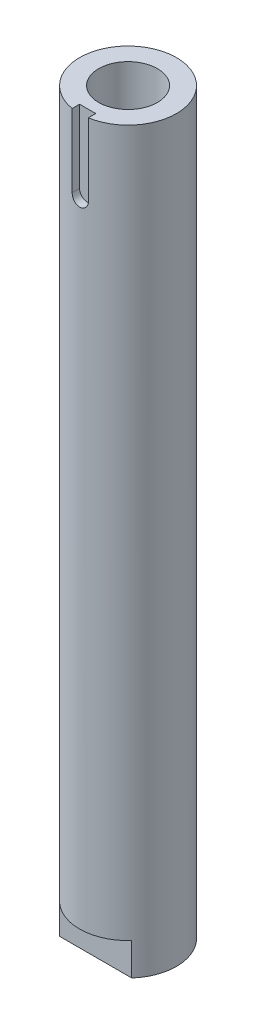
ISO-10303-21;
HEADER;
FILE_DESCRIPTION(('STEP AP214'),'2;1');
FILE_NAME('part.step','',(''),(''),'','','');
FILE_SCHEMA(('AUTOMOTIVE_DESIGN { 1 0 10303 214 1 1 1 1 }'));
ENDSEC;
DATA;
#1=APPLICATION_CONTEXT('core data for automotive mechanical design processes');
#2=APPLICATION_PROTOCOL_DEFINITION('international standard','automotive_design',2000,#1);
#3=PRODUCT_CONTEXT('',#1,'mechanical');
#4=PRODUCT('Part','Part','',(#3));
#5=PRODUCT_RELATED_PRODUCT_CATEGORY('part','',(#4));
#6=PRODUCT_DEFINITION_FORMATION('','',#4);
#7=PRODUCT_DEFINITION_CONTEXT('part definition',#1,'design');
#8=PRODUCT_DEFINITION('design','',#6,#7);
#9=PRODUCT_DEFINITION_SHAPE('','',#8);
#10=(LENGTH_UNIT() NAMED_UNIT(*) SI_UNIT(.MILLI.,.METRE.));
#11=(NAMED_UNIT(*) PLANE_ANGLE_UNIT() SI_UNIT($,.RADIAN.));
#12=(NAMED_UNIT(*) SI_UNIT($,.STERADIAN.) SOLID_ANGLE_UNIT());
#13=UNCERTAINTY_MEASURE_WITH_UNIT(LENGTH_MEASURE(1.E-05),#10,'distance_accuracy_value','');
#14=(GEOMETRIC_REPRESENTATION_CONTEXT(3) GLOBAL_UNCERTAINTY_ASSIGNED_CONTEXT((#13)) GLOBAL_UNIT_ASSIGNED_CONTEXT((#10,
#11,#12)) REPRESENTATION_CONTEXT('',''));
#15=CARTESIAN_POINT('',(0.,0.,0.));
#16=DIRECTION('',(0.,0.,1.));
#17=DIRECTION('',(1.,0.,0.));
#18=AXIS2_PLACEMENT_3D('',#15,#16,#17);
#19=CARTESIAN_POINT('',(0.,144.78,0.));
#20=DIRECTION('',(0.,-1.,0.));
#21=DIRECTION('',(0.,0.,-1.));
#22=AXIS2_PLACEMENT_3D('',#19,#20,#21);
#23=CYLINDRICAL_SURFACE('',#22,9.5);
#24=DIRECTION('',(0.,-1.,0.));
#25=VECTOR('',#24,1.);
#26=CARTESIAN_POINT('',(1.5875,144.78,9.36642107477557));
#27=LINE('',#26,#25);
#28=CARTESIAN_POINT('',(1.5875,144.78,9.36642107477557));
#29=VERTEX_POINT('',#28);
#30=CARTESIAN_POINT('',(1.5875,130.4925,9.36642107477557));
#31=VERTEX_POINT('',#30);
#32=EDGE_CURVE('E140',#29,#31,#27,.T.);
#33=ORIENTED_EDGE('',*,*,#32,.T.);
#34=CARTESIAN_POINT('',(1.5875,130.4925,9.36642107477557));
#35=CARTESIAN_POINT('',(1.58750007501885,130.448169619652,9.36641921892386));
#36=CARTESIAN_POINT('',(1.5856419610287,130.40386078706,9.3667361928873));
#37=CARTESIAN_POINT('',(1.57823162464586,130.315566372598,9.36798835641105));
#38=CARTESIAN_POINT('',(1.57267977304643,130.271580758729,9.36892348391838));
#39=CARTESIAN_POINT('',(1.55054841782113,130.14070457561,9.37262169247182));
#40=CARTESIAN_POINT('',(1.52849288862633,130.054700462017,9.37627776509836));
#41=CARTESIAN_POINT('',(1.47043626243605,129.887683140406,9.38555647204461));
#42=CARTESIAN_POINT('',(1.43443212041241,129.806671026636,9.39117953573891));
#43=CARTESIAN_POINT('',(1.34952212214638,129.651821922861,9.4037559197276));
#44=CARTESIAN_POINT('',(1.30061608396009,129.577985034062,9.41070925878129));
#45=CARTESIAN_POINT('',(1.19078282685551,129.438879530828,9.42523859478271));
#46=CARTESIAN_POINT('',(1.12975407847038,129.373691620099,9.43281951159274));
#47=CARTESIAN_POINT('',(0.997619851457473,129.254423749217,9.44770696834754));
#48=CARTESIAN_POINT('',(0.926512830712889,129.200345492105,9.45501346608552));
#49=CARTESIAN_POINT('',(0.775717083435957,129.104535370015,9.46858062743225));
#50=CARTESIAN_POINT('',(0.695979552642045,129.062879318183,9.47483477149543));
#51=CARTESIAN_POINT('',(0.530521537046084,128.993585198442,9.48553693059973));
#52=CARTESIAN_POINT('',(0.444801784471325,128.965945418345,9.48998516623226));
#53=CARTESIAN_POINT('',(0.270650909307135,128.925714455716,9.49653974390474));
#54=CARTESIAN_POINT('',(0.182252251484412,128.91298626881,9.49866739424712));
#55=CARTESIAN_POINT('',(0.00454802796144723,128.902513667192,9.50041431134813));
#56=CARTESIAN_POINT('',(-0.084757497112693,128.904768584193,9.50003368998238));
#57=CARTESIAN_POINT('',(-0.260798996441161,128.92409192674,9.49682371869066));
#58=CARTESIAN_POINT('',(-0.347551708269536,128.941012508969,9.49401880860184));
#59=CARTESIAN_POINT('',(-0.516968402398845,128.988953943214,9.48630271078437));
#60=CARTESIAN_POINT('',(-0.599632285720329,129.019975136384,9.48139147209503));
#61=CARTESIAN_POINT('',(-0.758966222269138,129.095384596139,9.46997286648615));
#62=CARTESIAN_POINT('',(-0.83560680666385,129.139833981496,9.46345822731532));
#63=CARTESIAN_POINT('',(-0.980394174284694,129.240791729489,9.44955687980754));
#64=CARTESIAN_POINT('',(-1.04854058158111,129.297300625548,9.44217013290156));
#65=CARTESIAN_POINT('',(-1.17527363343468,129.421584533438,9.42724032743146));
#66=CARTESIAN_POINT('',(-1.23373490550291,129.489487346269,9.41969645843769));
#67=CARTESIAN_POINT('',(-1.3384709684682,129.63422762956,9.40538672723832));
#68=CARTESIAN_POINT('',(-1.38474228632668,129.711067637347,9.39862108706645));
#69=CARTESIAN_POINT('',(-1.46381015666552,129.871657774666,9.38663241153215));
#70=CARTESIAN_POINT('',(-1.49658367361663,129.955419426754,9.38141201754237));
#71=CARTESIAN_POINT('',(-1.54751389900157,130.127308423917,9.37314662649488));
#72=CARTESIAN_POINT('',(-1.56569245947298,130.215429031809,9.37009837800357));
#73=CARTESIAN_POINT('',(-1.58004252304751,130.335600183159,9.36768235628324));
#74=CARTESIAN_POINT('',(-1.58284024148826,130.366940751575,9.36720979944117));
#75=CARTESIAN_POINT('',(-1.5865665471886,130.429682975478,9.36657947613833));
#76=CARTESIAN_POINT('',(-1.58749827781785,130.461084438885,9.36642118028978));
#77=CARTESIAN_POINT('',(-1.5875,130.4925,9.36642107477557));
#78=B_SPLINE_CURVE_WITH_KNOTS('',3,(#34,#35,#36,#37,#38,#39,#40,#41,#42,#43,#44,#45,#46,#47,#48,
#49,#50,#51,#52,#53,#54,#55,#56,#57,#58,#59,#60,#61,#62,#63,#64,#65,#66,#67,#68,#69,#70,#71,#72,
#73,#74,#75,#76,#77),.UNSPECIFIED.,.F.,.F.,(4,2,2,2,2,2,2,2,2,2,2,2,2,2,2,2,2,2,2,2,2,4),(0.,
0.13290846118484,0.265803582459427,0.531018714625842,0.796291776783844,1.06156858005068,
1.32916865818416,1.59680972717122,1.86605227558262,2.13526192616084,2.40197824342038,
2.66868266449888,2.93272932597956,3.19678237618886,3.46205585658109,3.72734107310766,
3.99582966128416,4.26439466199042,4.53341611886121,4.80203403307315,4.89639745955361,
4.99060179095765),.UNSPECIFIED.);
#79=CARTESIAN_POINT('',(-1.5875,130.4925,9.36642107477557));
#80=VERTEX_POINT('',#79);
#81=EDGE_CURVE('E11',#31,#80,#78,.T.);
#82=ORIENTED_EDGE('',*,*,#81,.T.);
#83=DIRECTION('',(0.,-1.,0.));
#84=VECTOR('',#83,1.);
#85=CARTESIAN_POINT('',(-1.5875,144.78,9.36642107477557));
#86=LINE('',#85,#84);
#87=CARTESIAN_POINT('',(-1.5875,144.78,9.36642107477557));
#88=VERTEX_POINT('',#87);
#89=EDGE_CURVE('E145',#80,#88,#86,.F.);
#90=ORIENTED_EDGE('',*,*,#89,.T.);
#91=CARTESIAN_POINT('',(0.,144.78,0.));
#92=DIRECTION('',(0.,1.,0.));
#93=DIRECTION('',(0.,0.,1.));
#94=AXIS2_PLACEMENT_3D('',#91,#92,#93);
#95=CIRCLE('',#94,9.5);
#96=EDGE_CURVE('E52',#29,#88,#95,.T.);
#97=ORIENTED_EDGE('',*,*,#96,.F.);
#98=EDGE_LOOP('',(#33,#82,#90,#97));
#99=FACE_BOUND('',#98,.T.);
#100=CARTESIAN_POINT('',(0.,6.35,0.));
#101=DIRECTION('',(0.,-1.,0.));
#102=DIRECTION('',(0.,0.,-1.));
#103=AXIS2_PLACEMENT_3D('',#100,#101,#102);
#104=CIRCLE('',#103,9.5);
#105=CARTESIAN_POINT('',(7.06593942798833,6.35,6.35));
#106=VERTEX_POINT('',#105);
#107=CARTESIAN_POINT('',(-7.06593942798833,6.35,6.35));
#108=VERTEX_POINT('',#107);
#109=EDGE_CURVE('E161',#106,#108,#104,.T.);
#110=ORIENTED_EDGE('',*,*,#109,.F.);
#111=DIRECTION('',(0.,-1.,0.));
#112=VECTOR('',#111,1.);
#113=CARTESIAN_POINT('',(7.06593942798833,6.35,6.35));
#114=LINE('',#113,#112);
#115=CARTESIAN_POINT('',(7.06593942798833,0.,6.35));
#116=VERTEX_POINT('',#115);
#117=EDGE_CURVE('E169',#106,#116,#114,.T.);
#118=ORIENTED_EDGE('',*,*,#117,.T.);
#119=CARTESIAN_POINT('',(0.,0.,0.));
#120=DIRECTION('',(0.,1.,0.));
#121=DIRECTION('',(0.,0.,1.));
#122=AXIS2_PLACEMENT_3D('',#119,#120,#121);
#123=CIRCLE('',#122,9.5);
#124=CARTESIAN_POINT('',(7.06593942798833,0.,-6.35));
#125=VERTEX_POINT('',#124);
#126=EDGE_CURVE('E186',#116,#125,#123,.T.);
#127=ORIENTED_EDGE('',*,*,#126,.T.);
#128=DIRECTION('',(0.,-1.,0.));
#129=VECTOR('',#128,1.);
#130=CARTESIAN_POINT('',(7.06593942798833,6.35,-6.35));
#131=LINE('',#130,#129);
#132=CARTESIAN_POINT('',(7.06593942798833,6.35,-6.35));
#133=VERTEX_POINT('',#132);
#134=EDGE_CURVE('E179',#133,#125,#131,.T.);
#135=ORIENTED_EDGE('',*,*,#134,.F.);
#136=CARTESIAN_POINT('',(0.,6.35,0.));
#137=DIRECTION('',(0.,-1.,0.));
#138=DIRECTION('',(0.,0.,-1.));
#139=AXIS2_PLACEMENT_3D('',#136,#137,#138);
#140=CIRCLE('',#139,9.5);
#141=CARTESIAN_POINT('',(-7.06593942798833,6.35,-6.35));
#142=VERTEX_POINT('',#141);
#143=EDGE_CURVE('E174',#142,#133,#140,.T.);
#144=ORIENTED_EDGE('',*,*,#143,.F.);
#145=DIRECTION('',(0.,-1.,0.));
#146=VECTOR('',#145,1.);
#147=CARTESIAN_POINT('',(-7.06593942798833,6.35,-6.35));
#148=LINE('',#147,#146);
#149=CARTESIAN_POINT('',(-7.06593942798833,0.,-6.35));
#150=VERTEX_POINT('',#149);
#151=EDGE_CURVE('E168',#142,#150,#148,.T.);
#152=ORIENTED_EDGE('',*,*,#151,.T.);
#153=CARTESIAN_POINT('',(-7.06593942798833,0.,6.35));
#154=VERTEX_POINT('',#153);
#155=EDGE_CURVE('E172',#150,#154,#123,.T.);
#156=ORIENTED_EDGE('',*,*,#155,.T.);
#157=DIRECTION('',(0.,-1.,0.));
#158=VECTOR('',#157,1.);
#159=CARTESIAN_POINT('',(-7.06593942798833,6.35,6.35));
#160=LINE('',#159,#158);
#161=EDGE_CURVE('E67',#108,#154,#160,.T.);
#162=ORIENTED_EDGE('',*,*,#161,.F.);
#163=EDGE_LOOP('',(#110,#118,#127,#135,#144,#152,#156,#162));
#164=FACE_BOUND('',#163,.T.);
#165=ADVANCED_FACE('F40',(#99,#164),#23,.T.);
#166=CARTESIAN_POINT('',(0.,144.78,0.));
#167=DIRECTION('',(0.,1.,0.));
#168=DIRECTION('',(0.,0.,1.));
#169=AXIS2_PLACEMENT_3D('',#166,#167,#168);
#170=PLANE('',#169);
#171=DIRECTION('',(0.,0.,1.));
#172=VECTOR('',#171,1.);
#173=CARTESIAN_POINT('',(-1.5875,144.78,7.9125));
#174=LINE('',#173,#172);
#175=CARTESIAN_POINT('',(-1.5875,144.78,7.9125));
#176=VERTEX_POINT('',#175);
#177=EDGE_CURVE('E141',#176,#88,#174,.T.);
#178=ORIENTED_EDGE('',*,*,#177,.F.);
#179=DIRECTION('',(-1.,0.,0.));
#180=VECTOR('',#179,1.);
#181=CARTESIAN_POINT('',(-1.5875,144.78,7.9125));
#182=LINE('',#181,#180);
#183=CARTESIAN_POINT('',(1.5875,144.78,7.9125));
#184=VERTEX_POINT('',#183);
#185=EDGE_CURVE('E130',#184,#176,#182,.T.);
#186=ORIENTED_EDGE('',*,*,#185,.F.);
#187=DIRECTION('',(0.,0.,1.));
#188=VECTOR('',#187,1.);
#189=CARTESIAN_POINT('',(1.5875,144.78,7.9125));
#190=LINE('',#189,#188);
#191=EDGE_CURVE('E124',#184,#29,#190,.T.);
#192=ORIENTED_EDGE('',*,*,#191,.T.);
#193=ORIENTED_EDGE('',*,*,#96,.T.);
#194=EDGE_LOOP('',(#178,#186,#192,#193));
#195=FACE_BOUND('',#194,.T.);
#196=CARTESIAN_POINT('',(0.,144.78,0.));
#197=DIRECTION('',(0.,1.,0.));
#198=DIRECTION('',(0.,0.,1.));
#199=AXIS2_PLACEMENT_3D('',#196,#197,#198);
#200=CIRCLE('',#199,5.75437);
#201=CARTESIAN_POINT('',(0.,144.78,5.75437));
#202=VERTEX_POINT('',#201);
#203=EDGE_CURVE('E148',#202,#202,#200,.T.);
#204=ORIENTED_EDGE('',*,*,#203,.F.);
#205=EDGE_LOOP('',(#204));
#206=FACE_BOUND('',#205,.T.);
#207=ADVANCED_FACE('F214',(#195,#206),#170,.T.);
#208=CARTESIAN_POINT('',(0.,0.,0.));
#209=DIRECTION('',(0.,1.,0.));
#210=DIRECTION('',(0.,0.,1.));
#211=AXIS2_PLACEMENT_3D('',#208,#209,#210);
#212=PLANE('',#211);
#213=CARTESIAN_POINT('',(0.,0.,0.));
#214=DIRECTION('',(0.,-1.,0.));
#215=DIRECTION('',(0.,0.,-1.));
#216=AXIS2_PLACEMENT_3D('',#213,#214,#215);
#217=CIRCLE('',#216,2.5527);
#218=CARTESIAN_POINT('',(0.,0.,-2.5527));
#219=VERTEX_POINT('',#218);
#220=EDGE_CURVE('E154',#219,#219,#217,.T.);
#221=ORIENTED_EDGE('',*,*,#220,.F.);
#222=EDGE_LOOP('',(#221));
#223=FACE_BOUND('',#222,.T.);
#224=ORIENTED_EDGE('',*,*,#126,.F.);
#225=DIRECTION('',(1.,0.,0.));
#226=VECTOR('',#225,1.);
#227=CARTESIAN_POINT('',(-7.06593942798833,0.,6.35));
#228=LINE('',#227,#226);
#229=EDGE_CURVE('E164',#154,#116,#228,.T.);
#230=ORIENTED_EDGE('',*,*,#229,.F.);
#231=ORIENTED_EDGE('',*,*,#155,.F.);
#232=DIRECTION('',(-1.,0.,0.));
#233=VECTOR('',#232,1.);
#234=CARTESIAN_POINT('',(-7.06593942798833,0.,-6.35));
#235=LINE('',#234,#233);
#236=EDGE_CURVE('E160',#125,#150,#235,.T.);
#237=ORIENTED_EDGE('',*,*,#236,.F.);
#238=EDGE_LOOP('',(#224,#230,#231,#237));
#239=FACE_BOUND('',#238,.T.);
#240=ADVANCED_FACE('F197',(#223,#239),#212,.F.);
#241=CARTESIAN_POINT('',(-7.06593942798833,6.35,-6.35));
#242=DIRECTION('',(0.,0.,1.));
#243=DIRECTION('',(1.,0.,0.));
#244=AXIS2_PLACEMENT_3D('',#241,#242,#243);
#245=PLANE('',#244);
#246=ORIENTED_EDGE('',*,*,#236,.T.);
#247=ORIENTED_EDGE('',*,*,#151,.F.);
#248=DIRECTION('',(-1.,0.,0.));
#249=VECTOR('',#248,1.);
#250=CARTESIAN_POINT('',(-7.06593942798833,6.35,-6.35));
#251=LINE('',#250,#249);
#252=EDGE_CURVE('E176',#133,#142,#251,.T.);
#253=ORIENTED_EDGE('',*,*,#252,.F.);
#254=ORIENTED_EDGE('',*,*,#134,.T.);
#255=EDGE_LOOP('',(#246,#247,#253,#254));
#256=FACE_BOUND('',#255,.T.);
#257=ADVANCED_FACE('F253',(#256),#245,.F.);
#258=CARTESIAN_POINT('',(0.,6.35,0.));
#259=DIRECTION('',(0.,-1.,0.));
#260=DIRECTION('',(0.,0.,-1.));
#261=AXIS2_PLACEMENT_3D('',#258,#259,#260);
#262=PLANE('',#261);
#263=ORIENTED_EDGE('',*,*,#143,.T.);
#264=ORIENTED_EDGE('',*,*,#252,.T.);
#265=EDGE_LOOP('',(#263,#264));
#266=FACE_BOUND('',#265,.T.);
#267=ADVANCED_FACE('F211',(#266),#262,.T.);
#268=CARTESIAN_POINT('',(-7.06593942798833,6.35,6.35));
#269=DIRECTION('',(0.,0.,-1.));
#270=DIRECTION('',(-1.,0.,0.));
#271=AXIS2_PLACEMENT_3D('',#268,#269,#270);
#272=PLANE('',#271);
#273=ORIENTED_EDGE('',*,*,#229,.T.);
#274=ORIENTED_EDGE('',*,*,#117,.F.);
#275=DIRECTION('',(1.,0.,0.));
#276=VECTOR('',#275,1.);
#277=CARTESIAN_POINT('',(-7.06593942798833,6.35,6.35));
#278=LINE('',#277,#276);
#279=EDGE_CURVE('E163',#108,#106,#278,.T.);
#280=ORIENTED_EDGE('',*,*,#279,.F.);
#281=ORIENTED_EDGE('',*,*,#161,.T.);
#282=EDGE_LOOP('',(#273,#274,#280,#281));
#283=FACE_BOUND('',#282,.T.);
#284=ADVANCED_FACE('F198',(#283),#272,.F.);
#285=CARTESIAN_POINT('',(0.,6.35,0.));
#286=DIRECTION('',(0.,-1.,0.));
#287=DIRECTION('',(0.,0.,-1.));
#288=AXIS2_PLACEMENT_3D('',#285,#286,#287);
#289=PLANE('',#288);
#290=ORIENTED_EDGE('',*,*,#109,.T.);
#291=ORIENTED_EDGE('',*,*,#279,.T.);
#292=EDGE_LOOP('',(#290,#291));
#293=FACE_BOUND('',#292,.T.);
#294=ADVANCED_FACE('F200',(#293),#289,.T.);
#295=CARTESIAN_POINT('',(0.,31.75,0.));
#296=DIRECTION('',(0.,-1.,0.));
#297=DIRECTION('',(0.,0.,-1.));
#298=AXIS2_PLACEMENT_3D('',#295,#296,#297);
#299=CONICAL_SURFACE('',#298,2.55269999999999,1.02974425867665);
#300=CARTESIAN_POINT('',(0.,33.2838169021917,0.));
#301=VERTEX_POINT('',#300);
#302=VERTEX_LOOP('',#301);
#303=FACE_BOUND('',#302,.T.);
#304=CARTESIAN_POINT('',(0.,31.75,0.));
#305=DIRECTION('',(0.,-1.,0.));
#306=DIRECTION('',(0.,0.,-1.));
#307=AXIS2_PLACEMENT_3D('',#304,#305,#306);
#308=CIRCLE('',#307,2.55269999999999);
#309=CARTESIAN_POINT('',(0.,31.75,-2.55269999999999));
#310=VERTEX_POINT('',#309);
#311=EDGE_CURVE('E157',#310,#310,#308,.T.);
#312=ORIENTED_EDGE('',*,*,#311,.T.);
#313=EDGE_LOOP('',(#312));
#314=FACE_BOUND('',#313,.T.);
#315=ADVANCED_FACE('F202',(#303,#314),#299,.F.);
#316=CARTESIAN_POINT('',(0.,0.,0.));
#317=DIRECTION('',(0.,-1.,0.));
#318=DIRECTION('',(0.,0.,-1.));
#319=AXIS2_PLACEMENT_3D('',#316,#317,#318);
#320=CYLINDRICAL_SURFACE('',#319,2.55269999999999);
#321=ORIENTED_EDGE('',*,*,#311,.F.);
#322=EDGE_LOOP('',(#321));
#323=FACE_BOUND('',#322,.T.);
#324=ORIENTED_EDGE('',*,*,#220,.T.);
#325=EDGE_LOOP('',(#324));
#326=FACE_BOUND('',#325,.T.);
#327=ADVANCED_FACE('F208',(#323,#326),#320,.F.);
#328=CARTESIAN_POINT('',(0.,113.03,0.));
#329=DIRECTION('',(0.,1.,0.));
#330=DIRECTION('',(0.,0.,1.));
#331=AXIS2_PLACEMENT_3D('',#328,#329,#330);
#332=CONICAL_SURFACE('',#331,5.75436999999999,1.02974425867665);
#333=CARTESIAN_POINT('',(0.,109.572425679686,0.));
#334=VERTEX_POINT('',#333);
#335=VERTEX_LOOP('',#334);
#336=FACE_BOUND('',#335,.T.);
#337=CARTESIAN_POINT('',(0.,113.03,0.));
#338=DIRECTION('',(0.,1.,0.));
#339=DIRECTION('',(0.,0.,1.));
#340=AXIS2_PLACEMENT_3D('',#337,#338,#339);
#341=CIRCLE('',#340,5.75436999999999);
#342=CARTESIAN_POINT('',(0.,113.03,5.75436999999999));
#343=VERTEX_POINT('',#342);
#344=EDGE_CURVE('E151',#343,#343,#341,.T.);
#345=ORIENTED_EDGE('',*,*,#344,.T.);
#346=EDGE_LOOP('',(#345));
#347=FACE_BOUND('',#346,.T.);
#348=ADVANCED_FACE('F239',(#336,#347),#332,.F.);
#349=CARTESIAN_POINT('',(0.,144.78,0.));
#350=DIRECTION('',(0.,1.,0.));
#351=DIRECTION('',(0.,0.,1.));
#352=AXIS2_PLACEMENT_3D('',#349,#350,#351);
#353=CYLINDRICAL_SURFACE('',#352,5.75436999999999);
#354=ORIENTED_EDGE('',*,*,#344,.F.);
#355=EDGE_LOOP('',(#354));
#356=FACE_BOUND('',#355,.T.);
#357=ORIENTED_EDGE('',*,*,#203,.T.);
#358=EDGE_LOOP('',(#357));
#359=FACE_BOUND('',#358,.T.);
#360=ADVANCED_FACE('F233',(#356,#359),#353,.F.);
#361=CARTESIAN_POINT('',(0.,130.4925,7.9125));
#362=DIRECTION('',(0.,0.,1.));
#363=DIRECTION('',(1.,0.,0.));
#364=AXIS2_PLACEMENT_3D('',#361,#362,#363);
#365=CYLINDRICAL_SURFACE('',#364,1.5875);
#366=DIRECTION('',(0.,0.,1.));
#367=VECTOR('',#366,1.);
#368=CARTESIAN_POINT('',(1.5875,130.4925,7.9125));
#369=LINE('',#368,#367);
#370=CARTESIAN_POINT('',(1.5875,130.4925,7.9125));
#371=VERTEX_POINT('',#370);
#372=EDGE_CURVE('E117',#371,#31,#369,.T.);
#373=ORIENTED_EDGE('',*,*,#372,.F.);
#374=CARTESIAN_POINT('',(0.,130.4925,7.9125));
#375=DIRECTION('',(0.,0.,1.));
#376=DIRECTION('',(1.,0.,0.));
#377=AXIS2_PLACEMENT_3D('',#374,#375,#376);
#378=CIRCLE('',#377,1.5875);
#379=CARTESIAN_POINT('',(-1.5875,130.4925,7.9125));
#380=VERTEX_POINT('',#379);
#381=EDGE_CURVE('E120',#380,#371,#378,.T.);
#382=ORIENTED_EDGE('',*,*,#381,.F.);
#383=DIRECTION('',(0.,0.,1.));
#384=VECTOR('',#383,1.);
#385=CARTESIAN_POINT('',(-1.5875,130.4925,7.9125));
#386=LINE('',#385,#384);
#387=EDGE_CURVE('E138',#380,#80,#386,.T.);
#388=ORIENTED_EDGE('',*,*,#387,.T.);
#389=ORIENTED_EDGE('',*,*,#81,.F.);
#390=EDGE_LOOP('',(#373,#382,#388,#389));
#391=FACE_BOUND('',#390,.T.);
#392=ADVANCED_FACE('F118',(#391),#365,.F.);
#393=CARTESIAN_POINT('',(-1.5875,130.4925,7.9125));
#394=DIRECTION('',(-1.,0.,0.));
#395=DIRECTION('',(0.,-1.,0.));
#396=AXIS2_PLACEMENT_3D('',#393,#394,#395);
#397=PLANE('',#396);
#398=ORIENTED_EDGE('',*,*,#387,.F.);
#399=DIRECTION('',(0.,-1.,0.));
#400=VECTOR('',#399,1.);
#401=CARTESIAN_POINT('',(-1.5875,130.4925,7.9125));
#402=LINE('',#401,#400);
#403=EDGE_CURVE('E125',#176,#380,#402,.T.);
#404=ORIENTED_EDGE('',*,*,#403,.F.);
#405=ORIENTED_EDGE('',*,*,#177,.T.);
#406=ORIENTED_EDGE('',*,*,#89,.F.);
#407=EDGE_LOOP('',(#398,#404,#405,#406));
#408=FACE_BOUND('',#407,.T.);
#409=ADVANCED_FACE('F225',(#408),#397,.F.);
#410=CARTESIAN_POINT('',(1.5875,144.78,7.9125));
#411=DIRECTION('',(1.,0.,0.));
#412=DIRECTION('',(0.,1.,0.));
#413=AXIS2_PLACEMENT_3D('',#410,#411,#412);
#414=PLANE('',#413);
#415=ORIENTED_EDGE('',*,*,#191,.F.);
#416=DIRECTION('',(0.,1.,0.));
#417=VECTOR('',#416,1.);
#418=CARTESIAN_POINT('',(1.5875,144.78,7.9125));
#419=LINE('',#418,#417);
#420=EDGE_CURVE('E59',#371,#184,#419,.T.);
#421=ORIENTED_EDGE('',*,*,#420,.F.);
#422=ORIENTED_EDGE('',*,*,#372,.T.);
#423=ORIENTED_EDGE('',*,*,#32,.F.);
#424=EDGE_LOOP('',(#415,#421,#422,#423));
#425=FACE_BOUND('',#424,.T.);
#426=ADVANCED_FACE('F127',(#425),#414,.F.);
#427=CARTESIAN_POINT('',(0.,130.4925,7.9125));
#428=DIRECTION('',(0.,0.,1.));
#429=DIRECTION('',(1.,0.,0.));
#430=AXIS2_PLACEMENT_3D('',#427,#428,#429);
#431=PLANE('',#430);
#432=ORIENTED_EDGE('',*,*,#381,.T.);
#433=ORIENTED_EDGE('',*,*,#420,.T.);
#434=ORIENTED_EDGE('',*,*,#185,.T.);
#435=ORIENTED_EDGE('',*,*,#403,.T.);
#436=EDGE_LOOP('',(#432,#433,#434,#435));
#437=FACE_BOUND('',#436,.T.);
#438=ADVANCED_FACE('F132',(#437),#431,.T.);
#439=CLOSED_SHELL('',(#165,#207,#240,#257,#267,#284,#294,#315,#327,#348,#360,#392,#409,#426,#438));
#440=MANIFOLD_SOLID_BREP('B2',#439);
#441=ADVANCED_BREP_SHAPE_REPRESENTATION('',(#18,#440),#14);
#442=SHAPE_DEFINITION_REPRESENTATION(#9,#441);
ENDSEC;
END-ISO-10303-21;
